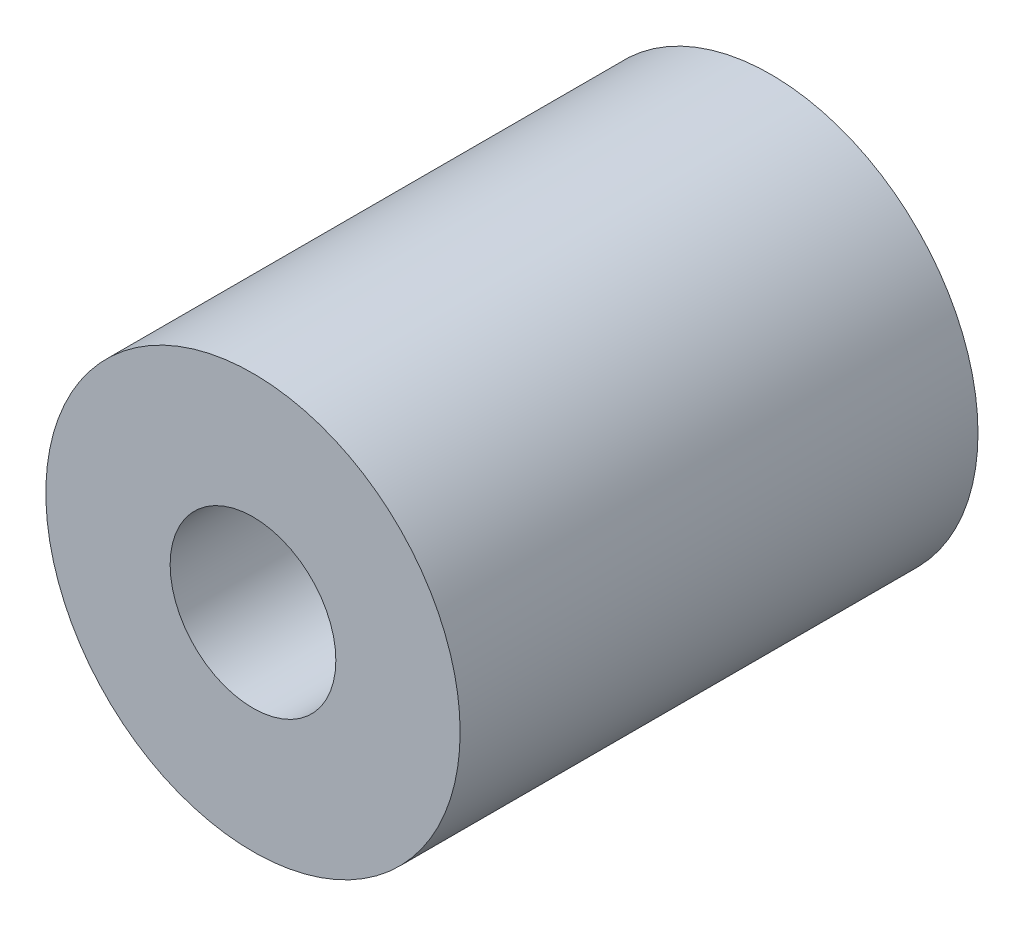
ISO-10303-21;
HEADER;
FILE_DESCRIPTION(('STEP AP214'),'2;1');
FILE_NAME('part.step','',(''),(''),'','','');
FILE_SCHEMA(('AUTOMOTIVE_DESIGN { 1 0 10303 214 1 1 1 1 }'));
ENDSEC;
DATA;
#1=APPLICATION_CONTEXT('core data for automotive mechanical design processes');
#2=APPLICATION_PROTOCOL_DEFINITION('international standard','automotive_design',2000,#1);
#3=PRODUCT_CONTEXT('',#1,'mechanical');
#4=PRODUCT('Part','Part','',(#3));
#5=PRODUCT_RELATED_PRODUCT_CATEGORY('part','',(#4));
#6=PRODUCT_DEFINITION_FORMATION('','',#4);
#7=PRODUCT_DEFINITION_CONTEXT('part definition',#1,'design');
#8=PRODUCT_DEFINITION('design','',#6,#7);
#9=PRODUCT_DEFINITION_SHAPE('','',#8);
#10=(LENGTH_UNIT() NAMED_UNIT(*) SI_UNIT(.MILLI.,.METRE.));
#11=(NAMED_UNIT(*) PLANE_ANGLE_UNIT() SI_UNIT($,.RADIAN.));
#12=(NAMED_UNIT(*) SI_UNIT($,.STERADIAN.) SOLID_ANGLE_UNIT());
#13=UNCERTAINTY_MEASURE_WITH_UNIT(LENGTH_MEASURE(1.E-05),#10,'distance_accuracy_value','');
#14=(GEOMETRIC_REPRESENTATION_CONTEXT(3) GLOBAL_UNCERTAINTY_ASSIGNED_CONTEXT((#13)) GLOBAL_UNIT_ASSIGNED_CONTEXT((#10,
#11,#12)) REPRESENTATION_CONTEXT('',''));
#15=CARTESIAN_POINT('',(0.,0.,0.));
#16=DIRECTION('',(0.,0.,1.));
#17=DIRECTION('',(1.,0.,0.));
#18=AXIS2_PLACEMENT_3D('',#15,#16,#17);
#19=CARTESIAN_POINT('',(0.,0.,5.));
#20=DIRECTION('',(0.,0.,1.));
#21=DIRECTION('',(1.,0.,0.));
#22=AXIS2_PLACEMENT_3D('',#19,#20,#21);
#23=PLANE('',#22);
#24=CARTESIAN_POINT('',(0.,0.,5.));
#25=DIRECTION('',(0.,0.,1.));
#26=DIRECTION('',(1.,0.,0.));
#27=AXIS2_PLACEMENT_3D('',#24,#25,#26);
#28=CIRCLE('',#27,4.);
#29=CARTESIAN_POINT('',(4.,0.,5.));
#30=VERTEX_POINT('',#29);
#31=EDGE_CURVE('E10',#30,#30,#28,.T.);
#32=ORIENTED_EDGE('',*,*,#31,.T.);
#33=EDGE_LOOP('',(#32));
#34=FACE_BOUND('',#33,.T.);
#35=CARTESIAN_POINT('',(0.,0.,5.));
#36=DIRECTION('',(0.,0.,1.));
#37=DIRECTION('',(1.,0.,0.));
#38=AXIS2_PLACEMENT_3D('',#35,#36,#37);
#39=CIRCLE('',#38,1.6);
#40=CARTESIAN_POINT('',(1.6,0.,5.));
#41=VERTEX_POINT('',#40);
#42=EDGE_CURVE('E37',#41,#41,#39,.T.);
#43=ORIENTED_EDGE('',*,*,#42,.F.);
#44=EDGE_LOOP('',(#43));
#45=FACE_BOUND('',#44,.T.);
#46=ADVANCED_FACE('F30',(#34,#45),#23,.T.);
#47=CARTESIAN_POINT('',(0.,0.,5.));
#48=DIRECTION('',(0.,0.,-1.));
#49=DIRECTION('',(-1.,0.,0.));
#50=AXIS2_PLACEMENT_3D('',#47,#48,#49);
#51=CYLINDRICAL_SURFACE('',#50,4.);
#52=ORIENTED_EDGE('',*,*,#31,.F.);
#53=EDGE_LOOP('',(#52));
#54=FACE_BOUND('',#53,.T.);
#55=CARTESIAN_POINT('',(0.,0.,-5.));
#56=DIRECTION('',(0.,0.,1.));
#57=DIRECTION('',(1.,0.,0.));
#58=AXIS2_PLACEMENT_3D('',#55,#56,#57);
#59=CIRCLE('',#58,4.);
#60=CARTESIAN_POINT('',(4.,0.,-5.));
#61=VERTEX_POINT('',#60);
#62=EDGE_CURVE('E41',#61,#61,#59,.T.);
#63=ORIENTED_EDGE('',*,*,#62,.T.);
#64=EDGE_LOOP('',(#63));
#65=FACE_BOUND('',#64,.T.);
#66=ADVANCED_FACE('F32',(#54,#65),#51,.T.);
#67=CARTESIAN_POINT('',(0.,0.,5.));
#68=DIRECTION('',(0.,0.,-1.));
#69=DIRECTION('',(-1.,0.,0.));
#70=AXIS2_PLACEMENT_3D('',#67,#68,#69);
#71=CYLINDRICAL_SURFACE('',#70,1.6);
#72=ORIENTED_EDGE('',*,*,#42,.T.);
#73=EDGE_LOOP('',(#72));
#74=FACE_BOUND('',#73,.T.);
#75=CARTESIAN_POINT('',(0.,0.,-5.));
#76=DIRECTION('',(0.,0.,1.));
#77=DIRECTION('',(1.,0.,0.));
#78=AXIS2_PLACEMENT_3D('',#75,#76,#77);
#79=CIRCLE('',#78,1.6);
#80=CARTESIAN_POINT('',(1.6,0.,-5.));
#81=VERTEX_POINT('',#80);
#82=EDGE_CURVE('E45',#81,#81,#79,.T.);
#83=ORIENTED_EDGE('',*,*,#82,.F.);
#84=EDGE_LOOP('',(#83));
#85=FACE_BOUND('',#84,.T.);
#86=ADVANCED_FACE('F54',(#74,#85),#71,.F.);
#87=CARTESIAN_POINT('',(0.,0.,-5.));
#88=DIRECTION('',(0.,0.,1.));
#89=DIRECTION('',(1.,0.,0.));
#90=AXIS2_PLACEMENT_3D('',#87,#88,#89);
#91=PLANE('',#90);
#92=ORIENTED_EDGE('',*,*,#82,.T.);
#93=EDGE_LOOP('',(#92));
#94=FACE_BOUND('',#93,.T.);
#95=ORIENTED_EDGE('',*,*,#62,.F.);
#96=EDGE_LOOP('',(#95));
#97=FACE_BOUND('',#96,.T.);
#98=ADVANCED_FACE('F51',(#94,#97),#91,.F.);
#99=CLOSED_SHELL('',(#46,#66,#86,#98));
#100=MANIFOLD_SOLID_BREP('B2',#99);
#101=ADVANCED_BREP_SHAPE_REPRESENTATION('',(#18,#100),#14);
#102=SHAPE_DEFINITION_REPRESENTATION(#9,#101);
ENDSEC;
END-ISO-10303-21;
